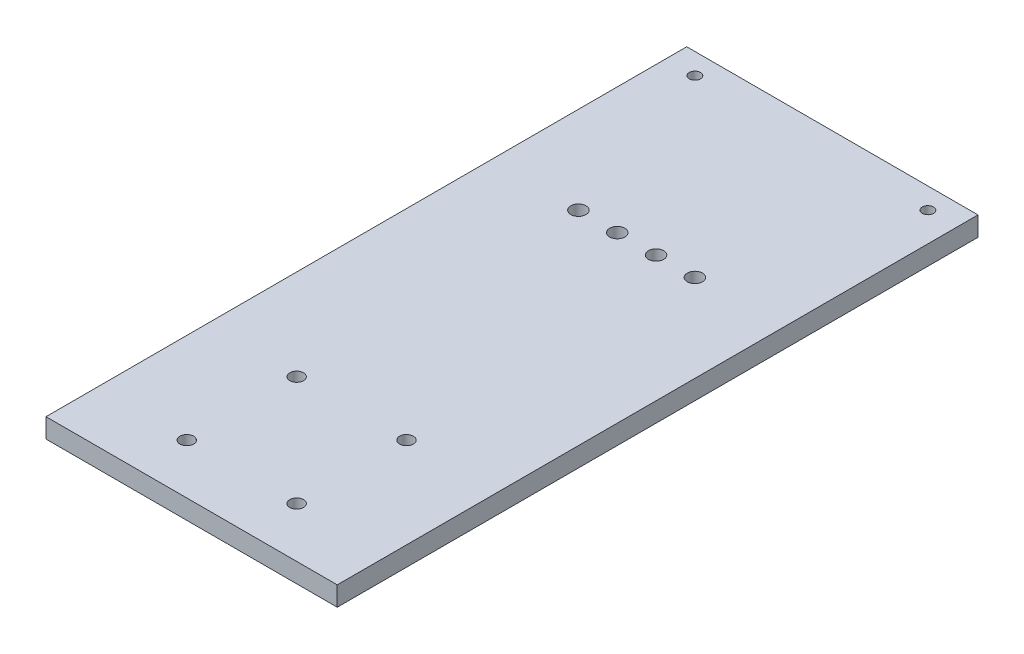
ISO-10303-21;
HEADER;
FILE_DESCRIPTION(('STEP AP214'),'2;1');
FILE_NAME('part.step','',(''),(''),'','','');
FILE_SCHEMA(('AUTOMOTIVE_DESIGN { 1 0 10303 214 1 1 1 1 }'));
ENDSEC;
DATA;
#1=APPLICATION_CONTEXT('core data for automotive mechanical design processes');
#2=APPLICATION_PROTOCOL_DEFINITION('international standard','automotive_design',2000,#1);
#3=PRODUCT_CONTEXT('',#1,'mechanical');
#4=PRODUCT('Part','Part','',(#3));
#5=PRODUCT_RELATED_PRODUCT_CATEGORY('part','',(#4));
#6=PRODUCT_DEFINITION_FORMATION('','',#4);
#7=PRODUCT_DEFINITION_CONTEXT('part definition',#1,'design');
#8=PRODUCT_DEFINITION('design','',#6,#7);
#9=PRODUCT_DEFINITION_SHAPE('','',#8);
#10=(LENGTH_UNIT() NAMED_UNIT(*) SI_UNIT(.MILLI.,.METRE.));
#11=(NAMED_UNIT(*) PLANE_ANGLE_UNIT() SI_UNIT($,.RADIAN.));
#12=(NAMED_UNIT(*) SI_UNIT($,.STERADIAN.) SOLID_ANGLE_UNIT());
#13=UNCERTAINTY_MEASURE_WITH_UNIT(LENGTH_MEASURE(1.E-05),#10,'distance_accuracy_value','');
#14=(GEOMETRIC_REPRESENTATION_CONTEXT(3) GLOBAL_UNCERTAINTY_ASSIGNED_CONTEXT((#13)) GLOBAL_UNIT_ASSIGNED_CONTEXT((#10,
#11,#12)) REPRESENTATION_CONTEXT('',''));
#15=CARTESIAN_POINT('',(0.,0.,0.));
#16=DIRECTION('',(0.,0.,1.));
#17=DIRECTION('',(1.,0.,0.));
#18=AXIS2_PLACEMENT_3D('',#15,#16,#17);
#19=CARTESIAN_POINT('',(-47.625,-6.35,31.7500000000001));
#20=DIRECTION('',(0.,-1.,0.));
#21=DIRECTION('',(0.,0.,-1.));
#22=AXIS2_PLACEMENT_3D('',#19,#20,#21);
#23=PLANE('',#22);
#24=CARTESIAN_POINT('',(-38.1,-6.35,-18.542));
#25=DIRECTION('',(0.,-1.,0.));
#26=DIRECTION('',(0.,0.,-1.));
#27=AXIS2_PLACEMENT_3D('',#24,#25,#26);
#28=CIRCLE('',#27,1.8288);
#29=CARTESIAN_POINT('',(-38.1,-6.35,-20.3708));
#30=VERTEX_POINT('',#29);
#31=EDGE_CURVE('E93',#30,#30,#28,.F.);
#32=ORIENTED_EDGE('',*,*,#31,.T.);
#33=EDGE_LOOP('',(#32));
#34=FACE_BOUND('',#33,.T.);
#35=CARTESIAN_POINT('',(38.1,-6.35,-18.542));
#36=DIRECTION('',(0.,-1.,0.));
#37=DIRECTION('',(0.,0.,-1.));
#38=AXIS2_PLACEMENT_3D('',#35,#36,#37);
#39=CIRCLE('',#38,1.8288);
#40=CARTESIAN_POINT('',(38.1,-6.35,-20.3708));
#41=VERTEX_POINT('',#40);
#42=EDGE_CURVE('E92',#41,#41,#39,.T.);
#43=ORIENTED_EDGE('',*,*,#42,.F.);
#44=EDGE_LOOP('',(#43));
#45=FACE_BOUND('',#44,.T.);
#46=DIRECTION('',(-1.,0.,0.));
#47=VECTOR('',#46,1.);
#48=CARTESIAN_POINT('',(0.,-6.35,-25.4));
#49=LINE('',#48,#47);
#50=CARTESIAN_POINT('',(47.625,-6.35,-25.4));
#51=VERTEX_POINT('',#50);
#52=CARTESIAN_POINT('',(-47.625,-6.35,-25.4));
#53=VERTEX_POINT('',#52);
#54=EDGE_CURVE('E80',#51,#53,#49,.T.);
#55=ORIENTED_EDGE('',*,*,#54,.F.);
#56=DIRECTION('',(0.,0.,-1.));
#57=VECTOR('',#56,1.);
#58=CARTESIAN_POINT('',(47.625,-6.35,184.15));
#59=LINE('',#58,#57);
#60=CARTESIAN_POINT('',(47.625,-6.35,184.15));
#61=VERTEX_POINT('',#60);
#62=EDGE_CURVE('E85',#61,#51,#59,.T.);
#63=ORIENTED_EDGE('',*,*,#62,.F.);
#64=DIRECTION('',(1.,0.,0.));
#65=VECTOR('',#64,1.);
#66=CARTESIAN_POINT('',(-47.625,-6.35,184.15));
#67=LINE('',#66,#65);
#68=CARTESIAN_POINT('',(-47.625,-6.35,184.15));
#69=VERTEX_POINT('',#68);
#70=EDGE_CURVE('E54',#69,#61,#67,.T.);
#71=ORIENTED_EDGE('',*,*,#70,.F.);
#72=DIRECTION('',(0.,0.,-1.));
#73=VECTOR('',#72,1.);
#74=CARTESIAN_POINT('',(-47.625,-6.35,184.15));
#75=LINE('',#74,#73);
#76=EDGE_CURVE('E77',#69,#53,#75,.T.);
#77=ORIENTED_EDGE('',*,*,#76,.T.);
#78=EDGE_LOOP('',(#55,#63,#71,#77));
#79=FACE_BOUND('',#78,.T.);
#80=CARTESIAN_POINT('',(6.34999999999999,-6.35,38.608));
#81=DIRECTION('',(0.,1.,0.));
#82=DIRECTION('',(0.,0.,1.));
#83=AXIS2_PLACEMENT_3D('',#80,#81,#82);
#84=CIRCLE('',#83,2.4892);
#85=CARTESIAN_POINT('',(6.34999999999999,-6.35,41.0972));
#86=VERTEX_POINT('',#85);
#87=EDGE_CURVE('E117',#86,#86,#84,.F.);
#88=ORIENTED_EDGE('',*,*,#87,.F.);
#89=EDGE_LOOP('',(#88));
#90=FACE_BOUND('',#89,.T.);
#91=CARTESIAN_POINT('',(19.05,-6.35,38.608));
#92=DIRECTION('',(0.,1.,0.));
#93=DIRECTION('',(0.,0.,1.));
#94=AXIS2_PLACEMENT_3D('',#91,#92,#93);
#95=CIRCLE('',#94,2.4892);
#96=CARTESIAN_POINT('',(19.05,-6.35,41.0972));
#97=VERTEX_POINT('',#96);
#98=EDGE_CURVE('E108',#97,#97,#95,.F.);
#99=ORIENTED_EDGE('',*,*,#98,.F.);
#100=EDGE_LOOP('',(#99));
#101=FACE_BOUND('',#100,.T.);
#102=CARTESIAN_POINT('',(-6.34999999999999,-6.35,38.608));
#103=DIRECTION('',(0.,1.,0.));
#104=DIRECTION('',(0.,0.,1.));
#105=AXIS2_PLACEMENT_3D('',#102,#103,#104);
#106=CIRCLE('',#105,2.4892);
#107=CARTESIAN_POINT('',(-6.34999999999999,-6.35,41.0972));
#108=VERTEX_POINT('',#107);
#109=EDGE_CURVE('E121',#108,#108,#106,.T.);
#110=ORIENTED_EDGE('',*,*,#109,.T.);
#111=EDGE_LOOP('',(#110));
#112=FACE_BOUND('',#111,.T.);
#113=CARTESIAN_POINT('',(-19.05,-6.35,38.608));
#114=DIRECTION('',(0.,1.,0.));
#115=DIRECTION('',(0.,0.,1.));
#116=AXIS2_PLACEMENT_3D('',#113,#114,#115);
#117=CIRCLE('',#116,2.4892);
#118=CARTESIAN_POINT('',(-19.05,-6.35,41.0972));
#119=VERTEX_POINT('',#118);
#120=EDGE_CURVE('E114',#119,#119,#117,.T.);
#121=ORIENTED_EDGE('',*,*,#120,.T.);
#122=EDGE_LOOP('',(#121));
#123=FACE_BOUND('',#122,.T.);
#124=CARTESIAN_POINT('',(-17.9605122421383,-6.35,131.845975515723));
#125=DIRECTION('',(0.,1.,0.));
#126=DIRECTION('',(0.,0.,1.));
#127=AXIS2_PLACEMENT_3D('',#124,#125,#126);
#128=CIRCLE('',#127,2.24789999999998);
#129=CARTESIAN_POINT('',(-20.2084122421383,-6.35,131.845975515723));
#130=VERTEX_POINT('',#129);
#131=EDGE_CURVE('E130',#130,#130,#128,.F.);
#132=ORIENTED_EDGE('',*,*,#131,.F.);
#133=EDGE_LOOP('',(#132));
#134=FACE_BOUND('',#133,.T.);
#135=CARTESIAN_POINT('',(17.9605122421383,-6.35,167.767));
#136=DIRECTION('',(0.,1.,0.));
#137=DIRECTION('',(0.,0.,1.));
#138=AXIS2_PLACEMENT_3D('',#135,#136,#137);
#139=CIRCLE('',#138,2.24789999999998);
#140=CARTESIAN_POINT('',(15.7126122421383,-6.35,167.767));
#141=VERTEX_POINT('',#140);
#142=EDGE_CURVE('E129',#141,#141,#139,.F.);
#143=ORIENTED_EDGE('',*,*,#142,.F.);
#144=EDGE_LOOP('',(#143));
#145=FACE_BOUND('',#144,.T.);
#146=CARTESIAN_POINT('',(17.9605122421383,-6.35,131.845975515723));
#147=DIRECTION('',(0.,1.,0.));
#148=DIRECTION('',(0.,0.,1.));
#149=AXIS2_PLACEMENT_3D('',#146,#147,#148);
#150=CIRCLE('',#149,2.24789999999998);
#151=CARTESIAN_POINT('',(15.7126122421383,-6.35,131.845975515723));
#152=VERTEX_POINT('',#151);
#153=EDGE_CURVE('E122',#152,#152,#150,.F.);
#154=ORIENTED_EDGE('',*,*,#153,.F.);
#155=EDGE_LOOP('',(#154));
#156=FACE_BOUND('',#155,.T.);
#157=CARTESIAN_POINT('',(-17.9605122421383,-6.35,167.767));
#158=DIRECTION('',(0.,1.,0.));
#159=DIRECTION('',(0.,0.,1.));
#160=AXIS2_PLACEMENT_3D('',#157,#158,#159);
#161=CIRCLE('',#160,2.24789999999998);
#162=CARTESIAN_POINT('',(-20.2084122421383,-6.35,167.767));
#163=VERTEX_POINT('',#162);
#164=EDGE_CURVE('E140',#163,#163,#161,.F.);
#165=ORIENTED_EDGE('',*,*,#164,.F.);
#166=EDGE_LOOP('',(#165));
#167=FACE_BOUND('',#166,.T.);
#168=ADVANCED_FACE('F37',(#34,#45,#79,#90,#101,#112,#123,#134,#145,#156,#167),#23,.T.);
#169=CARTESIAN_POINT('',(0.,0.,-25.4));
#170=DIRECTION('',(0.,0.,-1.));
#171=DIRECTION('',(-1.,0.,0.));
#172=AXIS2_PLACEMENT_3D('',#169,#170,#171);
#173=PLANE('',#172);
#174=DIRECTION('',(0.,1.,0.));
#175=VECTOR('',#174,1.);
#176=CARTESIAN_POINT('',(47.625,0.,-25.4));
#177=LINE('',#176,#175);
#178=CARTESIAN_POINT('',(47.625,0.,-25.4));
#179=VERTEX_POINT('',#178);
#180=EDGE_CURVE('E41',#51,#179,#177,.T.);
#181=ORIENTED_EDGE('',*,*,#180,.F.);
#182=ORIENTED_EDGE('',*,*,#54,.T.);
#183=DIRECTION('',(0.,-1.,0.));
#184=VECTOR('',#183,1.);
#185=CARTESIAN_POINT('',(-47.625,0.,-25.4));
#186=LINE('',#185,#184);
#187=CARTESIAN_POINT('',(-47.625,0.,-25.4));
#188=VERTEX_POINT('',#187);
#189=EDGE_CURVE('E91',#188,#53,#186,.T.);
#190=ORIENTED_EDGE('',*,*,#189,.F.);
#191=DIRECTION('',(-1.,0.,0.));
#192=VECTOR('',#191,1.);
#193=CARTESIAN_POINT('',(-47.625,0.,-25.4));
#194=LINE('',#193,#192);
#195=EDGE_CURVE('E98',#179,#188,#194,.T.);
#196=ORIENTED_EDGE('',*,*,#195,.F.);
#197=EDGE_LOOP('',(#181,#182,#190,#196));
#198=FACE_BOUND('',#197,.T.);
#199=ADVANCED_FACE('F89',(#198),#173,.T.);
#200=CARTESIAN_POINT('',(-47.625,0.,25.4));
#201=DIRECTION('',(0.,-1.,0.));
#202=DIRECTION('',(1.,0.,0.));
#203=AXIS2_PLACEMENT_3D('',#200,#201,#202);
#204=PLANE('',#203);
#205=CARTESIAN_POINT('',(6.35,0.,38.608));
#206=DIRECTION('',(0.,-1.,0.));
#207=DIRECTION('',(1.,0.,0.));
#208=AXIS2_PLACEMENT_3D('',#205,#206,#207);
#209=CIRCLE('',#208,2.4892);
#210=CARTESIAN_POINT('',(8.8392,0.,38.608));
#211=VERTEX_POINT('',#210);
#212=EDGE_CURVE('E46',#211,#211,#209,.T.);
#213=ORIENTED_EDGE('',*,*,#212,.T.);
#214=EDGE_LOOP('',(#213));
#215=FACE_BOUND('',#214,.T.);
#216=CARTESIAN_POINT('',(19.05,0.,38.608));
#217=DIRECTION('',(0.,-1.,0.));
#218=DIRECTION('',(1.,0.,0.));
#219=AXIS2_PLACEMENT_3D('',#216,#217,#218);
#220=CIRCLE('',#219,2.4892);
#221=CARTESIAN_POINT('',(21.5392,0.,38.608));
#222=VERTEX_POINT('',#221);
#223=EDGE_CURVE('E11',#222,#222,#220,.T.);
#224=ORIENTED_EDGE('',*,*,#223,.T.);
#225=EDGE_LOOP('',(#224));
#226=FACE_BOUND('',#225,.T.);
#227=CARTESIAN_POINT('',(-6.35,0.,38.608));
#228=DIRECTION('',(0.,1.,0.));
#229=DIRECTION('',(-1.,0.,0.));
#230=AXIS2_PLACEMENT_3D('',#227,#228,#229);
#231=CIRCLE('',#230,2.4892);
#232=CARTESIAN_POINT('',(-8.8392,0.,38.608));
#233=VERTEX_POINT('',#232);
#234=EDGE_CURVE('E110',#233,#233,#231,.T.);
#235=ORIENTED_EDGE('',*,*,#234,.F.);
#236=EDGE_LOOP('',(#235));
#237=FACE_BOUND('',#236,.T.);
#238=CARTESIAN_POINT('',(-19.05,0.,38.608));
#239=DIRECTION('',(0.,1.,0.));
#240=DIRECTION('',(-1.,0.,0.));
#241=AXIS2_PLACEMENT_3D('',#238,#239,#240);
#242=CIRCLE('',#241,2.4892);
#243=CARTESIAN_POINT('',(-21.5392,0.,38.608));
#244=VERTEX_POINT('',#243);
#245=EDGE_CURVE('E113',#244,#244,#242,.T.);
#246=ORIENTED_EDGE('',*,*,#245,.F.);
#247=EDGE_LOOP('',(#246));
#248=FACE_BOUND('',#247,.T.);
#249=CARTESIAN_POINT('',(-17.9605122421383,0.,131.845975515723));
#250=DIRECTION('',(0.,1.,0.));
#251=DIRECTION('',(-1.,0.,0.));
#252=AXIS2_PLACEMENT_3D('',#249,#250,#251);
#253=CIRCLE('',#252,2.24789999999998);
#254=CARTESIAN_POINT('',(-20.2084122421383,0.,131.845975515723));
#255=VERTEX_POINT('',#254);
#256=EDGE_CURVE('E126',#255,#255,#253,.T.);
#257=ORIENTED_EDGE('',*,*,#256,.F.);
#258=EDGE_LOOP('',(#257));
#259=FACE_BOUND('',#258,.T.);
#260=CARTESIAN_POINT('',(17.9605122421383,0.,167.767));
#261=DIRECTION('',(0.,1.,0.));
#262=DIRECTION('',(-1.,0.,0.));
#263=AXIS2_PLACEMENT_3D('',#260,#261,#262);
#264=CIRCLE('',#263,2.24789999999998);
#265=CARTESIAN_POINT('',(15.7126122421383,0.,167.767));
#266=VERTEX_POINT('',#265);
#267=EDGE_CURVE('E125',#266,#266,#264,.T.);
#268=ORIENTED_EDGE('',*,*,#267,.F.);
#269=EDGE_LOOP('',(#268));
#270=FACE_BOUND('',#269,.T.);
#271=CARTESIAN_POINT('',(17.9605122421383,0.,131.845975515723));
#272=DIRECTION('',(0.,1.,0.));
#273=DIRECTION('',(-1.,0.,0.));
#274=AXIS2_PLACEMENT_3D('',#271,#272,#273);
#275=CIRCLE('',#274,2.24789999999998);
#276=CARTESIAN_POINT('',(15.7126122421383,0.,131.845975515723));
#277=VERTEX_POINT('',#276);
#278=EDGE_CURVE('E118',#277,#277,#275,.T.);
#279=ORIENTED_EDGE('',*,*,#278,.F.);
#280=EDGE_LOOP('',(#279));
#281=FACE_BOUND('',#280,.T.);
#282=CARTESIAN_POINT('',(-17.9605122421383,0.,167.767));
#283=DIRECTION('',(0.,1.,0.));
#284=DIRECTION('',(-1.,0.,0.));
#285=AXIS2_PLACEMENT_3D('',#282,#283,#284);
#286=CIRCLE('',#285,2.24789999999998);
#287=CARTESIAN_POINT('',(-20.2084122421383,0.,167.767));
#288=VERTEX_POINT('',#287);
#289=EDGE_CURVE('E133',#288,#288,#286,.T.);
#290=ORIENTED_EDGE('',*,*,#289,.F.);
#291=EDGE_LOOP('',(#290));
#292=FACE_BOUND('',#291,.T.);
#293=CARTESIAN_POINT('',(38.1,0.,-18.542));
#294=DIRECTION('',(0.,-1.,0.));
#295=DIRECTION('',(1.,0.,0.));
#296=AXIS2_PLACEMENT_3D('',#293,#294,#295);
#297=CIRCLE('',#296,1.8288);
#298=CARTESIAN_POINT('',(39.9288,0.,-18.542));
#299=VERTEX_POINT('',#298);
#300=EDGE_CURVE('E143',#299,#299,#297,.T.);
#301=ORIENTED_EDGE('',*,*,#300,.T.);
#302=EDGE_LOOP('',(#301));
#303=FACE_BOUND('',#302,.T.);
#304=CARTESIAN_POINT('',(-38.1,0.,-18.542));
#305=DIRECTION('',(0.,1.,0.));
#306=DIRECTION('',(-1.,0.,0.));
#307=AXIS2_PLACEMENT_3D('',#304,#305,#306);
#308=CIRCLE('',#307,1.8288);
#309=CARTESIAN_POINT('',(-39.9288,0.,-18.542));
#310=VERTEX_POINT('',#309);
#311=EDGE_CURVE('E146',#310,#310,#308,.T.);
#312=ORIENTED_EDGE('',*,*,#311,.F.);
#313=EDGE_LOOP('',(#312));
#314=FACE_BOUND('',#313,.T.);
#315=ORIENTED_EDGE('',*,*,#195,.T.);
#316=DIRECTION('',(0.,0.,-1.));
#317=VECTOR('',#316,1.);
#318=CARTESIAN_POINT('',(-47.625,0.,25.4));
#319=LINE('',#318,#317);
#320=CARTESIAN_POINT('',(-47.625,0.,184.15));
#321=VERTEX_POINT('',#320);
#322=EDGE_CURVE('E97',#321,#188,#319,.T.);
#323=ORIENTED_EDGE('',*,*,#322,.F.);
#324=DIRECTION('',(-1.,0.,0.));
#325=VECTOR('',#324,1.);
#326=CARTESIAN_POINT('',(-47.625,0.,184.15));
#327=LINE('',#326,#325);
#328=CARTESIAN_POINT('',(47.625,0.,184.15));
#329=VERTEX_POINT('',#328);
#330=EDGE_CURVE('E154',#329,#321,#327,.T.);
#331=ORIENTED_EDGE('',*,*,#330,.F.);
#332=DIRECTION('',(0.,0.,-1.));
#333=VECTOR('',#332,1.);
#334=CARTESIAN_POINT('',(47.625,0.,25.4));
#335=LINE('',#334,#333);
#336=EDGE_CURVE('E100',#329,#179,#335,.T.);
#337=ORIENTED_EDGE('',*,*,#336,.T.);
#338=EDGE_LOOP('',(#315,#323,#331,#337));
#339=FACE_BOUND('',#338,.T.);
#340=ADVANCED_FACE('F197',(#215,#226,#237,#248,#259,#270,#281,#292,#303,#314,#339),#204,.F.);
#341=CARTESIAN_POINT('',(6.34999999999999,-41.275,38.608));
#342=DIRECTION('',(0.,1.,0.));
#343=DIRECTION('',(-1.,0.,0.));
#344=AXIS2_PLACEMENT_3D('',#341,#342,#343);
#345=CYLINDRICAL_SURFACE('',#344,2.4892);
#346=ORIENTED_EDGE('',*,*,#212,.F.);
#347=EDGE_LOOP('',(#346));
#348=FACE_BOUND('',#347,.T.);
#349=ORIENTED_EDGE('',*,*,#87,.T.);
#350=EDGE_LOOP('',(#349));
#351=FACE_BOUND('',#350,.T.);
#352=ADVANCED_FACE('F169',(#348,#351),#345,.F.);
#353=CARTESIAN_POINT('',(19.05,-41.275,38.608));
#354=DIRECTION('',(0.,1.,0.));
#355=DIRECTION('',(-1.,0.,0.));
#356=AXIS2_PLACEMENT_3D('',#353,#354,#355);
#357=CYLINDRICAL_SURFACE('',#356,2.4892);
#358=ORIENTED_EDGE('',*,*,#223,.F.);
#359=EDGE_LOOP('',(#358));
#360=FACE_BOUND('',#359,.T.);
#361=ORIENTED_EDGE('',*,*,#98,.T.);
#362=EDGE_LOOP('',(#361));
#363=FACE_BOUND('',#362,.T.);
#364=ADVANCED_FACE('F312',(#360,#363),#357,.F.);
#365=CARTESIAN_POINT('',(-6.34999999999999,-41.275,38.608));
#366=DIRECTION('',(0.,1.,0.));
#367=DIRECTION('',(-1.,0.,0.));
#368=AXIS2_PLACEMENT_3D('',#365,#366,#367);
#369=CYLINDRICAL_SURFACE('',#368,2.4892);
#370=ORIENTED_EDGE('',*,*,#234,.T.);
#371=EDGE_LOOP('',(#370));
#372=FACE_BOUND('',#371,.T.);
#373=ORIENTED_EDGE('',*,*,#109,.F.);
#374=EDGE_LOOP('',(#373));
#375=FACE_BOUND('',#374,.T.);
#376=ADVANCED_FACE('F303',(#372,#375),#369,.F.);
#377=CARTESIAN_POINT('',(-19.05,-41.275,38.608));
#378=DIRECTION('',(0.,1.,0.));
#379=DIRECTION('',(-1.,0.,0.));
#380=AXIS2_PLACEMENT_3D('',#377,#378,#379);
#381=CYLINDRICAL_SURFACE('',#380,2.4892);
#382=ORIENTED_EDGE('',*,*,#245,.T.);
#383=EDGE_LOOP('',(#382));
#384=FACE_BOUND('',#383,.T.);
#385=ORIENTED_EDGE('',*,*,#120,.F.);
#386=EDGE_LOOP('',(#385));
#387=FACE_BOUND('',#386,.T.);
#388=ADVANCED_FACE('F294',(#384,#387),#381,.F.);
#389=CARTESIAN_POINT('',(-17.9605122421383,-12.7080213337169,131.845975515723));
#390=DIRECTION('',(0.,1.,0.));
#391=DIRECTION('',(-1.,0.,0.));
#392=AXIS2_PLACEMENT_3D('',#389,#390,#391);
#393=CYLINDRICAL_SURFACE('',#392,2.24789999999998);
#394=CARTESIAN_POINT('',(-20.2084122421383,-6.35,131.845975515723));
#395=CARTESIAN_POINT('',(-20.2084122421383,-6.28385416666667,131.845975515723));
#396=CARTESIAN_POINT('',(-20.2084122421383,-6.21770833333334,131.845975515723));
#397=CARTESIAN_POINT('',(-20.2084122421383,-6.08541666666667,131.845975515723));
#398=CARTESIAN_POINT('',(-20.2084122421383,-6.01927083333334,131.845975515723));
#399=CARTESIAN_POINT('',(-20.2084122421383,-5.88697916666667,131.845975515723));
#400=CARTESIAN_POINT('',(-20.2084122421383,-5.82083333333334,131.845975515723));
#401=CARTESIAN_POINT('',(-20.2084122421383,-5.68854166666667,131.845975515723));
#402=CARTESIAN_POINT('',(-20.2084122421383,-5.62239583333334,131.845975515723));
#403=CARTESIAN_POINT('',(-20.2084122421383,-5.49010416666667,131.845975515723));
#404=CARTESIAN_POINT('',(-20.2084122421383,-5.42395833333334,131.845975515723));
#405=CARTESIAN_POINT('',(-20.2084122421383,-5.29166666666667,131.845975515723));
#406=CARTESIAN_POINT('',(-20.2084122421383,-5.22552083333334,131.845975515723));
#407=CARTESIAN_POINT('',(-20.2084122421383,-5.09322916666667,131.845975515723));
#408=CARTESIAN_POINT('',(-20.2084122421383,-5.02708333333334,131.845975515723));
#409=CARTESIAN_POINT('',(-20.2084122421383,-4.89479166666667,131.845975515723));
#410=CARTESIAN_POINT('',(-20.2084122421383,-4.82864583333334,131.845975515723));
#411=CARTESIAN_POINT('',(-20.2084122421383,-4.69635416666667,131.845975515723));
#412=CARTESIAN_POINT('',(-20.2084122421383,-4.63020833333334,131.845975515723));
#413=CARTESIAN_POINT('',(-20.2084122421383,-4.49791666666667,131.845975515723));
#414=CARTESIAN_POINT('',(-20.2084122421383,-4.43177083333334,131.845975515723));
#415=CARTESIAN_POINT('',(-20.2084122421383,-4.29947916666667,131.845975515723));
#416=CARTESIAN_POINT('',(-20.2084122421383,-4.23333333333334,131.845975515723));
#417=CARTESIAN_POINT('',(-20.2084122421383,-4.10104166666667,131.845975515723));
#418=CARTESIAN_POINT('',(-20.2084122421383,-4.03489583333334,131.845975515723));
#419=CARTESIAN_POINT('',(-20.2084122421383,-3.90260416666667,131.845975515723));
#420=CARTESIAN_POINT('',(-20.2084122421383,-3.83645833333334,131.845975515723));
#421=CARTESIAN_POINT('',(-20.2084122421383,-3.70416666666667,131.845975515723));
#422=CARTESIAN_POINT('',(-20.2084122421383,-3.63802083333334,131.845975515723));
#423=CARTESIAN_POINT('',(-20.2084122421383,-3.50572916666667,131.845975515723));
#424=CARTESIAN_POINT('',(-20.2084122421383,-3.43958333333334,131.845975515723));
#425=CARTESIAN_POINT('',(-20.2084122421383,-3.30729166666667,131.845975515723));
#426=CARTESIAN_POINT('',(-20.2084122421383,-3.24114583333334,131.845975515723));
#427=CARTESIAN_POINT('',(-20.2084122421383,-3.10885416666667,131.845975515723));
#428=CARTESIAN_POINT('',(-20.2084122421383,-3.04270833333334,131.845975515723));
#429=CARTESIAN_POINT('',(-20.2084122421383,-2.91041666666667,131.845975515723));
#430=CARTESIAN_POINT('',(-20.2084122421383,-2.84427083333334,131.845975515723));
#431=CARTESIAN_POINT('',(-20.2084122421383,-2.71197916666667,131.845975515723));
#432=CARTESIAN_POINT('',(-20.2084122421383,-2.64583333333334,131.845975515723));
#433=CARTESIAN_POINT('',(-20.2084122421383,-2.51354166666667,131.845975515723));
#434=CARTESIAN_POINT('',(-20.2084122421383,-2.44739583333334,131.845975515723));
#435=CARTESIAN_POINT('',(-20.2084122421383,-2.31510416666667,131.845975515723));
#436=CARTESIAN_POINT('',(-20.2084122421383,-2.24895833333334,131.845975515723));
#437=CARTESIAN_POINT('',(-20.2084122421383,-2.11666666666667,131.845975515723));
#438=CARTESIAN_POINT('',(-20.2084122421383,-2.05052083333334,131.845975515723));
#439=CARTESIAN_POINT('',(-20.2084122421383,-1.91822916666667,131.845975515723));
#440=CARTESIAN_POINT('',(-20.2084122421383,-1.85208333333334,131.845975515723));
#441=CARTESIAN_POINT('',(-20.2084122421383,-1.71979166666667,131.845975515723));
#442=CARTESIAN_POINT('',(-20.2084122421383,-1.65364583333334,131.845975515723));
#443=CARTESIAN_POINT('',(-20.2084122421383,-1.52135416666667,131.845975515723));
#444=CARTESIAN_POINT('',(-20.2084122421383,-1.45520833333334,131.845975515723));
#445=CARTESIAN_POINT('',(-20.2084122421383,-1.32291666666667,131.845975515723));
#446=CARTESIAN_POINT('',(-20.2084122421383,-1.25677083333334,131.845975515723));
#447=CARTESIAN_POINT('',(-20.2084122421383,-1.12447916666667,131.845975515723));
#448=CARTESIAN_POINT('',(-20.2084122421383,-1.05833333333334,131.845975515723));
#449=CARTESIAN_POINT('',(-20.2084122421383,-0.926041666666672,131.845975515723));
#450=CARTESIAN_POINT('',(-20.2084122421383,-0.859895833333338,131.845975515723));
#451=CARTESIAN_POINT('',(-20.2084122421383,-0.727604166666671,131.845975515723));
#452=CARTESIAN_POINT('',(-20.2084122421383,-0.661458333333339,131.845975515723));
#453=CARTESIAN_POINT('',(-20.2084122421383,-0.529166666666672,131.845975515723));
#454=CARTESIAN_POINT('',(-20.2084122421383,-0.463020833333338,131.845975515723));
#455=CARTESIAN_POINT('',(-20.2084122421383,-0.330729166666671,131.845975515723));
#456=CARTESIAN_POINT('',(-20.2084122421383,-0.264583333333338,131.845975515723));
#457=CARTESIAN_POINT('',(-20.2084122421383,-0.132291666666671,131.845975515723));
#458=CARTESIAN_POINT('',(-20.2084122421383,-0.0661458333333382,131.845975515723));
#459=CARTESIAN_POINT('',(-20.2084122421383,0.,131.845975515723));
#460=B_SPLINE_CURVE_WITH_KNOTS('',3,(#394,#395,#396,#397,#398,#399,#400,#401,#402,#403,#404,
#405,#406,#407,#408,#409,#410,#411,#412,#413,#414,#415,#416,#417,#418,#419,#420,#421,#422,#423,
#424,#425,#426,#427,#428,#429,#430,#431,#432,#433,#434,#435,#436,#437,#438,#439,#440,#441,#442,
#443,#444,#445,#446,#447,#448,#449,#450,#451,#452,#453,#454,#455,#456,#457,#458,#459),
.UNSPECIFIED.,.F.,.F.,(4,2,2,2,2,2,2,2,2,2,2,2,2,2,2,2,2,2,2,2,2,2,2,2,2,2,2,2,2,2,2,2,4),(0.,
0.1984375,0.396875,0.595312499999999,0.793749999999999,0.9921875,1.190625,1.3890625,1.5875,
1.7859375,1.984375,2.1828125,2.38125,2.5796875,2.778125,2.9765625,3.175,3.3734375,3.571875,
3.7703125,3.96875,4.1671875,4.365625,4.5640625,4.7625,4.9609375,5.159375,5.3578125,5.55625,
5.7546875,5.953125,6.1515625,6.35),.UNSPECIFIED.);
#461=EDGE_CURVE('BSEAM285',#130,#255,#460,.T.);
#462=ORIENTED_EDGE('',*,*,#131,.T.);
#463=ORIENTED_EDGE('',*,*,#256,.T.);
#464=ORIENTED_EDGE('',*,*,#461,.T.);
#465=ORIENTED_EDGE('',*,*,#461,.F.);
#466=EDGE_LOOP('',(#462,#464,#463,#465));
#467=FACE_BOUND('',#466,.T.);
#468=ADVANCED_FACE('F285',(#467),#393,.F.);
#469=CARTESIAN_POINT('',(17.9605122421383,-12.7080213337169,167.767));
#470=DIRECTION('',(0.,1.,0.));
#471=DIRECTION('',(-1.,0.,0.));
#472=AXIS2_PLACEMENT_3D('',#469,#470,#471);
#473=CYLINDRICAL_SURFACE('',#472,2.24789999999998);
#474=CARTESIAN_POINT('',(15.7126122421383,-6.35,167.767));
#475=CARTESIAN_POINT('',(15.7126122421383,-6.28385416666667,167.767));
#476=CARTESIAN_POINT('',(15.7126122421383,-6.21770833333334,167.767));
#477=CARTESIAN_POINT('',(15.7126122421383,-6.08541666666667,167.767));
#478=CARTESIAN_POINT('',(15.7126122421383,-6.01927083333334,167.767));
#479=CARTESIAN_POINT('',(15.7126122421383,-5.88697916666667,167.767));
#480=CARTESIAN_POINT('',(15.7126122421383,-5.82083333333333,167.767));
#481=CARTESIAN_POINT('',(15.7126122421383,-5.68854166666667,167.767));
#482=CARTESIAN_POINT('',(15.7126122421383,-5.62239583333333,167.767));
#483=CARTESIAN_POINT('',(15.7126122421383,-5.49010416666667,167.767));
#484=CARTESIAN_POINT('',(15.7126122421383,-5.42395833333333,167.767));
#485=CARTESIAN_POINT('',(15.7126122421383,-5.29166666666667,167.767));
#486=CARTESIAN_POINT('',(15.7126122421383,-5.22552083333333,167.767));
#487=CARTESIAN_POINT('',(15.7126122421383,-5.09322916666667,167.767));
#488=CARTESIAN_POINT('',(15.7126122421383,-5.02708333333333,167.767));
#489=CARTESIAN_POINT('',(15.7126122421383,-4.89479166666667,167.767));
#490=CARTESIAN_POINT('',(15.7126122421383,-4.82864583333333,167.767));
#491=CARTESIAN_POINT('',(15.7126122421383,-4.69635416666667,167.767));
#492=CARTESIAN_POINT('',(15.7126122421383,-4.63020833333333,167.767));
#493=CARTESIAN_POINT('',(15.7126122421383,-4.49791666666667,167.767));
#494=CARTESIAN_POINT('',(15.7126122421383,-4.43177083333333,167.767));
#495=CARTESIAN_POINT('',(15.7126122421383,-4.29947916666667,167.767));
#496=CARTESIAN_POINT('',(15.7126122421383,-4.23333333333333,167.767));
#497=CARTESIAN_POINT('',(15.7126122421383,-4.10104166666667,167.767));
#498=CARTESIAN_POINT('',(15.7126122421383,-4.03489583333333,167.767));
#499=CARTESIAN_POINT('',(15.7126122421383,-3.90260416666667,167.767));
#500=CARTESIAN_POINT('',(15.7126122421383,-3.83645833333333,167.767));
#501=CARTESIAN_POINT('',(15.7126122421383,-3.70416666666667,167.767));
#502=CARTESIAN_POINT('',(15.7126122421383,-3.63802083333333,167.767));
#503=CARTESIAN_POINT('',(15.7126122421383,-3.50572916666667,167.767));
#504=CARTESIAN_POINT('',(15.7126122421383,-3.43958333333333,167.767));
#505=CARTESIAN_POINT('',(15.7126122421383,-3.30729166666667,167.767));
#506=CARTESIAN_POINT('',(15.7126122421383,-3.24114583333333,167.767));
#507=CARTESIAN_POINT('',(15.7126122421383,-3.10885416666667,167.767));
#508=CARTESIAN_POINT('',(15.7126122421383,-3.04270833333333,167.767));
#509=CARTESIAN_POINT('',(15.7126122421383,-2.91041666666667,167.767));
#510=CARTESIAN_POINT('',(15.7126122421383,-2.84427083333333,167.767));
#511=CARTESIAN_POINT('',(15.7126122421383,-2.71197916666667,167.767));
#512=CARTESIAN_POINT('',(15.7126122421383,-2.64583333333333,167.767));
#513=CARTESIAN_POINT('',(15.7126122421383,-2.51354166666667,167.767));
#514=CARTESIAN_POINT('',(15.7126122421383,-2.44739583333333,167.767));
#515=CARTESIAN_POINT('',(15.7126122421383,-2.31510416666667,167.767));
#516=CARTESIAN_POINT('',(15.7126122421383,-2.24895833333333,167.767));
#517=CARTESIAN_POINT('',(15.7126122421383,-2.11666666666667,167.767));
#518=CARTESIAN_POINT('',(15.7126122421383,-2.05052083333333,167.767));
#519=CARTESIAN_POINT('',(15.7126122421383,-1.91822916666667,167.767));
#520=CARTESIAN_POINT('',(15.7126122421383,-1.85208333333333,167.767));
#521=CARTESIAN_POINT('',(15.7126122421383,-1.71979166666667,167.767));
#522=CARTESIAN_POINT('',(15.7126122421383,-1.65364583333333,167.767));
#523=CARTESIAN_POINT('',(15.7126122421383,-1.52135416666667,167.767));
#524=CARTESIAN_POINT('',(15.7126122421383,-1.45520833333333,167.767));
#525=CARTESIAN_POINT('',(15.7126122421383,-1.32291666666667,167.767));
#526=CARTESIAN_POINT('',(15.7126122421383,-1.25677083333333,167.767));
#527=CARTESIAN_POINT('',(15.7126122421383,-1.12447916666667,167.767));
#528=CARTESIAN_POINT('',(15.7126122421383,-1.05833333333333,167.767));
#529=CARTESIAN_POINT('',(15.7126122421383,-0.926041666666666,167.767));
#530=CARTESIAN_POINT('',(15.7126122421383,-0.859895833333333,167.767));
#531=CARTESIAN_POINT('',(15.7126122421383,-0.727604166666666,167.767));
#532=CARTESIAN_POINT('',(15.7126122421383,-0.661458333333332,167.767));
#533=CARTESIAN_POINT('',(15.7126122421383,-0.529166666666666,167.767));
#534=CARTESIAN_POINT('',(15.7126122421383,-0.463020833333333,167.767));
#535=CARTESIAN_POINT('',(15.7126122421383,-0.330729166666665,167.767));
#536=CARTESIAN_POINT('',(15.7126122421383,-0.264583333333331,167.767));
#537=CARTESIAN_POINT('',(15.7126122421383,-0.132291666666664,167.767));
#538=CARTESIAN_POINT('',(15.7126122421383,-0.0661458333333312,167.767));
#539=CARTESIAN_POINT('',(15.7126122421383,0.,167.767));
#540=B_SPLINE_CURVE_WITH_KNOTS('',3,(#474,#475,#476,#477,#478,#479,#480,#481,#482,#483,#484,
#485,#486,#487,#488,#489,#490,#491,#492,#493,#494,#495,#496,#497,#498,#499,#500,#501,#502,#503,
#504,#505,#506,#507,#508,#509,#510,#511,#512,#513,#514,#515,#516,#517,#518,#519,#520,#521,#522,
#523,#524,#525,#526,#527,#528,#529,#530,#531,#532,#533,#534,#535,#536,#537,#538,#539),
.UNSPECIFIED.,.F.,.F.,(4,2,2,2,2,2,2,2,2,2,2,2,2,2,2,2,2,2,2,2,2,2,2,2,2,2,2,2,2,2,2,2,4),(0.,
0.1984375,0.396875000000001,0.5953125,0.793750000000001,0.992187500000001,1.190625,1.3890625,
1.5875,1.7859375,1.984375,2.1828125,2.38125,2.5796875,2.778125,2.9765625,3.175,3.3734375,
3.571875,3.7703125,3.96875,4.1671875,4.365625,4.5640625,4.7625,4.9609375,5.159375,5.3578125,
5.55625,5.7546875,5.953125,6.15156250000001,6.35),.UNSPECIFIED.);
#541=EDGE_CURVE('BSEAM276',#141,#266,#540,.T.);
#542=ORIENTED_EDGE('',*,*,#142,.T.);
#543=ORIENTED_EDGE('',*,*,#267,.T.);
#544=ORIENTED_EDGE('',*,*,#541,.T.);
#545=ORIENTED_EDGE('',*,*,#541,.F.);
#546=EDGE_LOOP('',(#542,#544,#543,#545));
#547=FACE_BOUND('',#546,.T.);
#548=ADVANCED_FACE('F276',(#547),#473,.F.);
#549=CARTESIAN_POINT('',(17.9605122421383,-12.7080213337169,131.845975515723));
#550=DIRECTION('',(0.,1.,0.));
#551=DIRECTION('',(-1.,0.,0.));
#552=AXIS2_PLACEMENT_3D('',#549,#550,#551);
#553=CYLINDRICAL_SURFACE('',#552,2.24789999999998);
#554=CARTESIAN_POINT('',(15.7126122421383,-6.35,131.845975515723));
#555=CARTESIAN_POINT('',(15.7126122421383,-6.28385416666667,131.845975515723));
#556=CARTESIAN_POINT('',(15.7126122421383,-6.21770833333334,131.845975515723));
#557=CARTESIAN_POINT('',(15.7126122421383,-6.08541666666667,131.845975515723));
#558=CARTESIAN_POINT('',(15.7126122421383,-6.01927083333334,131.845975515723));
#559=CARTESIAN_POINT('',(15.7126122421383,-5.88697916666667,131.845975515723));
#560=CARTESIAN_POINT('',(15.7126122421383,-5.82083333333333,131.845975515723));
#561=CARTESIAN_POINT('',(15.7126122421383,-5.68854166666667,131.845975515723));
#562=CARTESIAN_POINT('',(15.7126122421383,-5.62239583333333,131.845975515723));
#563=CARTESIAN_POINT('',(15.7126122421383,-5.49010416666667,131.845975515723));
#564=CARTESIAN_POINT('',(15.7126122421383,-5.42395833333333,131.845975515723));
#565=CARTESIAN_POINT('',(15.7126122421383,-5.29166666666667,131.845975515723));
#566=CARTESIAN_POINT('',(15.7126122421383,-5.22552083333333,131.845975515723));
#567=CARTESIAN_POINT('',(15.7126122421383,-5.09322916666667,131.845975515723));
#568=CARTESIAN_POINT('',(15.7126122421383,-5.02708333333333,131.845975515723));
#569=CARTESIAN_POINT('',(15.7126122421383,-4.89479166666667,131.845975515723));
#570=CARTESIAN_POINT('',(15.7126122421383,-4.82864583333333,131.845975515723));
#571=CARTESIAN_POINT('',(15.7126122421383,-4.69635416666667,131.845975515723));
#572=CARTESIAN_POINT('',(15.7126122421383,-4.63020833333333,131.845975515723));
#573=CARTESIAN_POINT('',(15.7126122421383,-4.49791666666667,131.845975515723));
#574=CARTESIAN_POINT('',(15.7126122421383,-4.43177083333333,131.845975515723));
#575=CARTESIAN_POINT('',(15.7126122421383,-4.29947916666667,131.845975515723));
#576=CARTESIAN_POINT('',(15.7126122421383,-4.23333333333333,131.845975515723));
#577=CARTESIAN_POINT('',(15.7126122421383,-4.10104166666667,131.845975515723));
#578=CARTESIAN_POINT('',(15.7126122421383,-4.03489583333333,131.845975515723));
#579=CARTESIAN_POINT('',(15.7126122421383,-3.90260416666667,131.845975515723));
#580=CARTESIAN_POINT('',(15.7126122421383,-3.83645833333333,131.845975515723));
#581=CARTESIAN_POINT('',(15.7126122421383,-3.70416666666667,131.845975515723));
#582=CARTESIAN_POINT('',(15.7126122421383,-3.63802083333333,131.845975515723));
#583=CARTESIAN_POINT('',(15.7126122421383,-3.50572916666667,131.845975515723));
#584=CARTESIAN_POINT('',(15.7126122421383,-3.43958333333333,131.845975515723));
#585=CARTESIAN_POINT('',(15.7126122421383,-3.30729166666667,131.845975515723));
#586=CARTESIAN_POINT('',(15.7126122421383,-3.24114583333333,131.845975515723));
#587=CARTESIAN_POINT('',(15.7126122421383,-3.10885416666667,131.845975515723));
#588=CARTESIAN_POINT('',(15.7126122421383,-3.04270833333333,131.845975515723));
#589=CARTESIAN_POINT('',(15.7126122421383,-2.91041666666667,131.845975515723));
#590=CARTESIAN_POINT('',(15.7126122421383,-2.84427083333333,131.845975515723));
#591=CARTESIAN_POINT('',(15.7126122421383,-2.71197916666667,131.845975515723));
#592=CARTESIAN_POINT('',(15.7126122421383,-2.64583333333333,131.845975515723));
#593=CARTESIAN_POINT('',(15.7126122421383,-2.51354166666667,131.845975515723));
#594=CARTESIAN_POINT('',(15.7126122421383,-2.44739583333333,131.845975515723));
#595=CARTESIAN_POINT('',(15.7126122421383,-2.31510416666667,131.845975515723));
#596=CARTESIAN_POINT('',(15.7126122421383,-2.24895833333333,131.845975515723));
#597=CARTESIAN_POINT('',(15.7126122421383,-2.11666666666667,131.845975515723));
#598=CARTESIAN_POINT('',(15.7126122421383,-2.05052083333333,131.845975515723));
#599=CARTESIAN_POINT('',(15.7126122421383,-1.91822916666667,131.845975515723));
#600=CARTESIAN_POINT('',(15.7126122421383,-1.85208333333333,131.845975515723));
#601=CARTESIAN_POINT('',(15.7126122421383,-1.71979166666667,131.845975515723));
#602=CARTESIAN_POINT('',(15.7126122421383,-1.65364583333333,131.845975515723));
#603=CARTESIAN_POINT('',(15.7126122421383,-1.52135416666667,131.845975515723));
#604=CARTESIAN_POINT('',(15.7126122421383,-1.45520833333333,131.845975515723));
#605=CARTESIAN_POINT('',(15.7126122421383,-1.32291666666667,131.845975515723));
#606=CARTESIAN_POINT('',(15.7126122421383,-1.25677083333333,131.845975515723));
#607=CARTESIAN_POINT('',(15.7126122421383,-1.12447916666667,131.845975515723));
#608=CARTESIAN_POINT('',(15.7126122421383,-1.05833333333333,131.845975515723));
#609=CARTESIAN_POINT('',(15.7126122421383,-0.926041666666666,131.845975515723));
#610=CARTESIAN_POINT('',(15.7126122421383,-0.859895833333333,131.845975515723));
#611=CARTESIAN_POINT('',(15.7126122421383,-0.727604166666666,131.845975515723));
#612=CARTESIAN_POINT('',(15.7126122421383,-0.661458333333332,131.845975515723));
#613=CARTESIAN_POINT('',(15.7126122421383,-0.529166666666666,131.845975515723));
#614=CARTESIAN_POINT('',(15.7126122421383,-0.463020833333333,131.845975515723));
#615=CARTESIAN_POINT('',(15.7126122421383,-0.330729166666665,131.845975515723));
#616=CARTESIAN_POINT('',(15.7126122421383,-0.264583333333331,131.845975515723));
#617=CARTESIAN_POINT('',(15.7126122421383,-0.132291666666664,131.845975515723));
#618=CARTESIAN_POINT('',(15.7126122421383,-0.0661458333333312,131.845975515723));
#619=CARTESIAN_POINT('',(15.7126122421383,0.,131.845975515723));
#620=B_SPLINE_CURVE_WITH_KNOTS('',3,(#554,#555,#556,#557,#558,#559,#560,#561,#562,#563,#564,
#565,#566,#567,#568,#569,#570,#571,#572,#573,#574,#575,#576,#577,#578,#579,#580,#581,#582,#583,
#584,#585,#586,#587,#588,#589,#590,#591,#592,#593,#594,#595,#596,#597,#598,#599,#600,#601,#602,
#603,#604,#605,#606,#607,#608,#609,#610,#611,#612,#613,#614,#615,#616,#617,#618,#619),
.UNSPECIFIED.,.F.,.F.,(4,2,2,2,2,2,2,2,2,2,2,2,2,2,2,2,2,2,2,2,2,2,2,2,2,2,2,2,2,2,2,2,4),(0.,
0.1984375,0.396875000000001,0.5953125,0.793750000000001,0.992187500000001,1.190625,1.3890625,
1.5875,1.7859375,1.984375,2.1828125,2.38125,2.5796875,2.778125,2.9765625,3.175,3.3734375,
3.571875,3.7703125,3.96875,4.1671875,4.365625,4.5640625,4.7625,4.9609375,5.159375,5.3578125,
5.55625,5.7546875,5.953125,6.15156250000001,6.35),.UNSPECIFIED.);
#621=EDGE_CURVE('BSEAM193',#152,#277,#620,.T.);
#622=ORIENTED_EDGE('',*,*,#153,.T.);
#623=ORIENTED_EDGE('',*,*,#278,.T.);
#624=ORIENTED_EDGE('',*,*,#621,.T.);
#625=ORIENTED_EDGE('',*,*,#621,.F.);
#626=EDGE_LOOP('',(#622,#624,#623,#625));
#627=FACE_BOUND('',#626,.T.);
#628=ADVANCED_FACE('F193',(#627),#553,.F.);
#629=CARTESIAN_POINT('',(-17.9605122421383,-12.7080213337169,167.767));
#630=DIRECTION('',(0.,1.,0.));
#631=DIRECTION('',(-1.,0.,0.));
#632=AXIS2_PLACEMENT_3D('',#629,#630,#631);
#633=CYLINDRICAL_SURFACE('',#632,2.24789999999998);
#634=CARTESIAN_POINT('',(-20.2084122421383,-6.35,167.767));
#635=CARTESIAN_POINT('',(-20.2084122421383,-6.28385416666667,167.767));
#636=CARTESIAN_POINT('',(-20.2084122421383,-6.21770833333334,167.767));
#637=CARTESIAN_POINT('',(-20.2084122421383,-6.08541666666667,167.767));
#638=CARTESIAN_POINT('',(-20.2084122421383,-6.01927083333334,167.767));
#639=CARTESIAN_POINT('',(-20.2084122421383,-5.88697916666667,167.767));
#640=CARTESIAN_POINT('',(-20.2084122421383,-5.82083333333334,167.767));
#641=CARTESIAN_POINT('',(-20.2084122421383,-5.68854166666667,167.767));
#642=CARTESIAN_POINT('',(-20.2084122421383,-5.62239583333334,167.767));
#643=CARTESIAN_POINT('',(-20.2084122421383,-5.49010416666667,167.767));
#644=CARTESIAN_POINT('',(-20.2084122421383,-5.42395833333334,167.767));
#645=CARTESIAN_POINT('',(-20.2084122421383,-5.29166666666667,167.767));
#646=CARTESIAN_POINT('',(-20.2084122421383,-5.22552083333334,167.767));
#647=CARTESIAN_POINT('',(-20.2084122421383,-5.09322916666667,167.767));
#648=CARTESIAN_POINT('',(-20.2084122421383,-5.02708333333334,167.767));
#649=CARTESIAN_POINT('',(-20.2084122421383,-4.89479166666667,167.767));
#650=CARTESIAN_POINT('',(-20.2084122421383,-4.82864583333334,167.767));
#651=CARTESIAN_POINT('',(-20.2084122421383,-4.69635416666667,167.767));
#652=CARTESIAN_POINT('',(-20.2084122421383,-4.63020833333334,167.767));
#653=CARTESIAN_POINT('',(-20.2084122421383,-4.49791666666667,167.767));
#654=CARTESIAN_POINT('',(-20.2084122421383,-4.43177083333334,167.767));
#655=CARTESIAN_POINT('',(-20.2084122421383,-4.29947916666667,167.767));
#656=CARTESIAN_POINT('',(-20.2084122421383,-4.23333333333334,167.767));
#657=CARTESIAN_POINT('',(-20.2084122421383,-4.10104166666667,167.767));
#658=CARTESIAN_POINT('',(-20.2084122421383,-4.03489583333334,167.767));
#659=CARTESIAN_POINT('',(-20.2084122421383,-3.90260416666667,167.767));
#660=CARTESIAN_POINT('',(-20.2084122421383,-3.83645833333334,167.767));
#661=CARTESIAN_POINT('',(-20.2084122421383,-3.70416666666667,167.767));
#662=CARTESIAN_POINT('',(-20.2084122421383,-3.63802083333334,167.767));
#663=CARTESIAN_POINT('',(-20.2084122421383,-3.50572916666667,167.767));
#664=CARTESIAN_POINT('',(-20.2084122421383,-3.43958333333334,167.767));
#665=CARTESIAN_POINT('',(-20.2084122421383,-3.30729166666667,167.767));
#666=CARTESIAN_POINT('',(-20.2084122421383,-3.24114583333334,167.767));
#667=CARTESIAN_POINT('',(-20.2084122421383,-3.10885416666667,167.767));
#668=CARTESIAN_POINT('',(-20.2084122421383,-3.04270833333334,167.767));
#669=CARTESIAN_POINT('',(-20.2084122421383,-2.91041666666667,167.767));
#670=CARTESIAN_POINT('',(-20.2084122421383,-2.84427083333334,167.767));
#671=CARTESIAN_POINT('',(-20.2084122421383,-2.71197916666667,167.767));
#672=CARTESIAN_POINT('',(-20.2084122421383,-2.64583333333334,167.767));
#673=CARTESIAN_POINT('',(-20.2084122421383,-2.51354166666667,167.767));
#674=CARTESIAN_POINT('',(-20.2084122421383,-2.44739583333334,167.767));
#675=CARTESIAN_POINT('',(-20.2084122421383,-2.31510416666667,167.767));
#676=CARTESIAN_POINT('',(-20.2084122421383,-2.24895833333334,167.767));
#677=CARTESIAN_POINT('',(-20.2084122421383,-2.11666666666667,167.767));
#678=CARTESIAN_POINT('',(-20.2084122421383,-2.05052083333334,167.767));
#679=CARTESIAN_POINT('',(-20.2084122421383,-1.91822916666667,167.767));
#680=CARTESIAN_POINT('',(-20.2084122421383,-1.85208333333334,167.767));
#681=CARTESIAN_POINT('',(-20.2084122421383,-1.71979166666667,167.767));
#682=CARTESIAN_POINT('',(-20.2084122421383,-1.65364583333334,167.767));
#683=CARTESIAN_POINT('',(-20.2084122421383,-1.52135416666667,167.767));
#684=CARTESIAN_POINT('',(-20.2084122421383,-1.45520833333334,167.767));
#685=CARTESIAN_POINT('',(-20.2084122421383,-1.32291666666667,167.767));
#686=CARTESIAN_POINT('',(-20.2084122421383,-1.25677083333334,167.767));
#687=CARTESIAN_POINT('',(-20.2084122421383,-1.12447916666667,167.767));
#688=CARTESIAN_POINT('',(-20.2084122421383,-1.05833333333334,167.767));
#689=CARTESIAN_POINT('',(-20.2084122421383,-0.926041666666672,167.767));
#690=CARTESIAN_POINT('',(-20.2084122421383,-0.859895833333338,167.767));
#691=CARTESIAN_POINT('',(-20.2084122421383,-0.727604166666671,167.767));
#692=CARTESIAN_POINT('',(-20.2084122421383,-0.661458333333339,167.767));
#693=CARTESIAN_POINT('',(-20.2084122421383,-0.529166666666672,167.767));
#694=CARTESIAN_POINT('',(-20.2084122421383,-0.463020833333338,167.767));
#695=CARTESIAN_POINT('',(-20.2084122421383,-0.330729166666671,167.767));
#696=CARTESIAN_POINT('',(-20.2084122421383,-0.264583333333338,167.767));
#697=CARTESIAN_POINT('',(-20.2084122421383,-0.132291666666671,167.767));
#698=CARTESIAN_POINT('',(-20.2084122421383,-0.0661458333333382,167.767));
#699=CARTESIAN_POINT('',(-20.2084122421383,0.,167.767));
#700=B_SPLINE_CURVE_WITH_KNOTS('',3,(#634,#635,#636,#637,#638,#639,#640,#641,#642,#643,#644,
#645,#646,#647,#648,#649,#650,#651,#652,#653,#654,#655,#656,#657,#658,#659,#660,#661,#662,#663,
#664,#665,#666,#667,#668,#669,#670,#671,#672,#673,#674,#675,#676,#677,#678,#679,#680,#681,#682,
#683,#684,#685,#686,#687,#688,#689,#690,#691,#692,#693,#694,#695,#696,#697,#698,#699),
.UNSPECIFIED.,.F.,.F.,(4,2,2,2,2,2,2,2,2,2,2,2,2,2,2,2,2,2,2,2,2,2,2,2,2,2,2,2,2,2,2,2,4),(0.,
0.1984375,0.396875,0.595312499999999,0.793749999999999,0.9921875,1.190625,1.3890625,1.5875,
1.7859375,1.984375,2.1828125,2.38125,2.5796875,2.778125,2.9765625,3.175,3.3734375,3.571875,
3.7703125,3.96875,4.1671875,4.365625,4.5640625,4.7625,4.9609375,5.159375,5.3578125,5.55625,
5.7546875,5.953125,6.1515625,6.35),.UNSPECIFIED.);
#701=EDGE_CURVE('BSEAM189',#163,#288,#700,.T.);
#702=ORIENTED_EDGE('',*,*,#164,.T.);
#703=ORIENTED_EDGE('',*,*,#289,.T.);
#704=ORIENTED_EDGE('',*,*,#701,.T.);
#705=ORIENTED_EDGE('',*,*,#701,.F.);
#706=EDGE_LOOP('',(#702,#704,#703,#705));
#707=FACE_BOUND('',#706,.T.);
#708=ADVANCED_FACE('F189',(#707),#633,.F.);
#709=CARTESIAN_POINT('',(38.1,-12.7,-18.542));
#710=DIRECTION('',(0.,1.,0.));
#711=DIRECTION('',(-1.,0.,0.));
#712=AXIS2_PLACEMENT_3D('',#709,#710,#711);
#713=CYLINDRICAL_SURFACE('',#712,1.8288);
#714=ORIENTED_EDGE('',*,*,#300,.F.);
#715=EDGE_LOOP('',(#714));
#716=FACE_BOUND('',#715,.T.);
#717=ORIENTED_EDGE('',*,*,#42,.T.);
#718=EDGE_LOOP('',(#717));
#719=FACE_BOUND('',#718,.T.);
#720=ADVANCED_FACE('F192',(#716,#719),#713,.F.);
#721=CARTESIAN_POINT('',(-38.1,-12.7,-18.542));
#722=DIRECTION('',(0.,1.,0.));
#723=DIRECTION('',(-1.,0.,0.));
#724=AXIS2_PLACEMENT_3D('',#721,#722,#723);
#725=CYLINDRICAL_SURFACE('',#724,1.8288);
#726=ORIENTED_EDGE('',*,*,#311,.T.);
#727=EDGE_LOOP('',(#726));
#728=FACE_BOUND('',#727,.T.);
#729=ORIENTED_EDGE('',*,*,#31,.F.);
#730=EDGE_LOOP('',(#729));
#731=FACE_BOUND('',#730,.T.);
#732=ADVANCED_FACE('F39',(#728,#731),#725,.F.);
#733=CARTESIAN_POINT('',(47.625,0.,25.4));
#734=DIRECTION('',(-1.,0.,0.));
#735=DIRECTION('',(0.,-1.,0.));
#736=AXIS2_PLACEMENT_3D('',#733,#734,#735);
#737=PLANE('',#736);
#738=ORIENTED_EDGE('',*,*,#62,.T.);
#739=ORIENTED_EDGE('',*,*,#180,.T.);
#740=ORIENTED_EDGE('',*,*,#336,.F.);
#741=DIRECTION('',(0.,1.,0.));
#742=VECTOR('',#741,1.);
#743=CARTESIAN_POINT('',(47.625,0.,184.15));
#744=LINE('',#743,#742);
#745=EDGE_CURVE('E152',#61,#329,#744,.T.);
#746=ORIENTED_EDGE('',*,*,#745,.F.);
#747=EDGE_LOOP('',(#738,#739,#740,#746));
#748=FACE_BOUND('',#747,.T.);
#749=ADVANCED_FACE('F209',(#748),#737,.F.);
#750=CARTESIAN_POINT('',(-47.625,0.,25.4));
#751=DIRECTION('',(1.,0.,0.));
#752=DIRECTION('',(0.,0.,-1.));
#753=AXIS2_PLACEMENT_3D('',#750,#751,#752);
#754=PLANE('',#753);
#755=ORIENTED_EDGE('',*,*,#189,.T.);
#756=ORIENTED_EDGE('',*,*,#76,.F.);
#757=DIRECTION('',(0.,-1.,0.));
#758=VECTOR('',#757,1.);
#759=CARTESIAN_POINT('',(-47.625,0.,184.15));
#760=LINE('',#759,#758);
#761=EDGE_CURVE('E149',#321,#69,#760,.T.);
#762=ORIENTED_EDGE('',*,*,#761,.F.);
#763=ORIENTED_EDGE('',*,*,#322,.T.);
#764=EDGE_LOOP('',(#755,#756,#762,#763));
#765=FACE_BOUND('',#764,.T.);
#766=ADVANCED_FACE('F96',(#765),#754,.F.);
#767=CARTESIAN_POINT('',(0.,0.,184.15));
#768=DIRECTION('',(0.,0.,1.));
#769=DIRECTION('',(1.,0.,0.));
#770=AXIS2_PLACEMENT_3D('',#767,#768,#769);
#771=PLANE('',#770);
#772=ORIENTED_EDGE('',*,*,#761,.T.);
#773=ORIENTED_EDGE('',*,*,#70,.T.);
#774=ORIENTED_EDGE('',*,*,#745,.T.);
#775=ORIENTED_EDGE('',*,*,#330,.T.);
#776=EDGE_LOOP('',(#772,#773,#774,#775));
#777=FACE_BOUND('',#776,.T.);
#778=ADVANCED_FACE('F174',(#777),#771,.T.);
#779=CLOSED_SHELL('',(#168,#199,#340,#352,#364,#376,#388,#468,#548,#628,#708,#720,#732,#749,
#766,#778));
#780=MANIFOLD_SOLID_BREP('B2',#779);
#781=ADVANCED_BREP_SHAPE_REPRESENTATION('',(#18,#780),#14);
#782=SHAPE_DEFINITION_REPRESENTATION(#9,#781);
ENDSEC;
END-ISO-10303-21;
